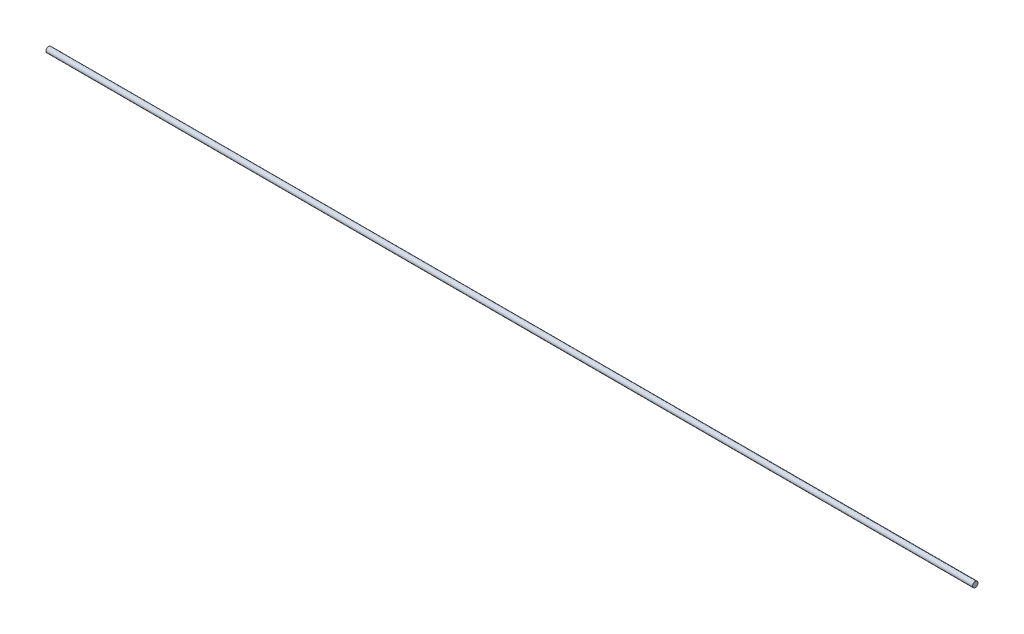
ISO-10303-21;
HEADER;
FILE_DESCRIPTION(('STEP AP214'),'2;1');
FILE_NAME('part.step','',(''),(''),'','','');
FILE_SCHEMA(('AUTOMOTIVE_DESIGN { 1 0 10303 214 1 1 1 1 }'));
ENDSEC;
DATA;
#1=APPLICATION_CONTEXT('core data for automotive mechanical design processes');
#2=APPLICATION_PROTOCOL_DEFINITION('international standard','automotive_design',2000,#1);
#3=PRODUCT_CONTEXT('',#1,'mechanical');
#4=PRODUCT('Part','Part','',(#3));
#5=PRODUCT_RELATED_PRODUCT_CATEGORY('part','',(#4));
#6=PRODUCT_DEFINITION_FORMATION('','',#4);
#7=PRODUCT_DEFINITION_CONTEXT('part definition',#1,'design');
#8=PRODUCT_DEFINITION('design','',#6,#7);
#9=PRODUCT_DEFINITION_SHAPE('','',#8);
#10=(LENGTH_UNIT() NAMED_UNIT(*) SI_UNIT(.MILLI.,.METRE.));
#11=(NAMED_UNIT(*) PLANE_ANGLE_UNIT() SI_UNIT($,.RADIAN.));
#12=(NAMED_UNIT(*) SI_UNIT($,.STERADIAN.) SOLID_ANGLE_UNIT());
#13=UNCERTAINTY_MEASURE_WITH_UNIT(LENGTH_MEASURE(1.E-05),#10,'distance_accuracy_value','');
#14=(GEOMETRIC_REPRESENTATION_CONTEXT(3) GLOBAL_UNCERTAINTY_ASSIGNED_CONTEXT((#13)) GLOBAL_UNIT_ASSIGNED_CONTEXT((#10,
#11,#12)) REPRESENTATION_CONTEXT('',''));
#15=CARTESIAN_POINT('',(0.,0.,0.));
#16=DIRECTION('',(0.,0.,1.));
#17=DIRECTION('',(1.,0.,0.));
#18=AXIS2_PLACEMENT_3D('',#15,#16,#17);
#19=CARTESIAN_POINT('',(511.,0.,0.));
#20=DIRECTION('',(1.,0.,0.));
#21=DIRECTION('',(0.,0.,-1.));
#22=AXIS2_PLACEMENT_3D('',#19,#20,#21);
#23=PLANE('',#22);
#24=CARTESIAN_POINT('',(511.,0.,0.));
#25=DIRECTION('',(1.,0.,0.));
#26=DIRECTION('',(0.,0.,-1.));
#27=AXIS2_PLACEMENT_3D('',#24,#25,#26);
#28=CIRCLE('',#27,3.);
#29=CARTESIAN_POINT('',(511.,0.,-3.));
#30=VERTEX_POINT('',#29);
#31=EDGE_CURVE('E10',#30,#30,#28,.T.);
#32=ORIENTED_EDGE('',*,*,#31,.T.);
#33=EDGE_LOOP('',(#32));
#34=FACE_BOUND('',#33,.T.);
#35=CARTESIAN_POINT('',(511.,0.,0.));
#36=DIRECTION('',(1.,0.,0.));
#37=DIRECTION('',(0.,0.,-1.));
#38=AXIS2_PLACEMENT_3D('',#35,#36,#37);
#39=CIRCLE('',#38,0.00299999999999996);
#40=CARTESIAN_POINT('',(511.,0.,-0.00299999999999996));
#41=VERTEX_POINT('',#40);
#42=EDGE_CURVE('E42',#41,#41,#39,.T.);
#43=ORIENTED_EDGE('',*,*,#42,.F.);
#44=EDGE_LOOP('',(#43));
#45=FACE_BOUND('',#44,.T.);
#46=ADVANCED_FACE('F31',(#34,#45),#23,.T.);
#47=CARTESIAN_POINT('',(-511.,0.,0.));
#48=DIRECTION('',(1.,0.,0.));
#49=DIRECTION('',(0.,0.,-1.));
#50=AXIS2_PLACEMENT_3D('',#47,#48,#49);
#51=PLANE('',#50);
#52=CARTESIAN_POINT('',(-511.,0.,0.));
#53=DIRECTION('',(1.,0.,0.));
#54=DIRECTION('',(0.,0.,-1.));
#55=AXIS2_PLACEMENT_3D('',#52,#53,#54);
#56=CIRCLE('',#55,3.);
#57=CARTESIAN_POINT('',(-511.,0.,-3.));
#58=VERTEX_POINT('',#57);
#59=EDGE_CURVE('E35',#58,#58,#56,.T.);
#60=ORIENTED_EDGE('',*,*,#59,.F.);
#61=EDGE_LOOP('',(#60));
#62=FACE_BOUND('',#61,.T.);
#63=CARTESIAN_POINT('',(-511.,0.,0.));
#64=DIRECTION('',(1.,0.,0.));
#65=DIRECTION('',(0.,0.,-1.));
#66=AXIS2_PLACEMENT_3D('',#63,#64,#65);
#67=CIRCLE('',#66,0.00299999999999996);
#68=CARTESIAN_POINT('',(-511.,0.,-0.00299999999999996));
#69=VERTEX_POINT('',#68);
#70=EDGE_CURVE('E44',#69,#69,#67,.T.);
#71=ORIENTED_EDGE('',*,*,#70,.T.);
#72=EDGE_LOOP('',(#71));
#73=FACE_BOUND('',#72,.T.);
#74=ADVANCED_FACE('F54',(#62,#73),#51,.F.);
#75=CARTESIAN_POINT('',(511.,0.,0.));
#76=DIRECTION('',(-1.,0.,0.));
#77=DIRECTION('',(0.,0.,1.));
#78=AXIS2_PLACEMENT_3D('',#75,#76,#77);
#79=CYLINDRICAL_SURFACE('',#78,3.);
#80=ORIENTED_EDGE('',*,*,#31,.F.);
#81=EDGE_LOOP('',(#80));
#82=FACE_BOUND('',#81,.T.);
#83=ORIENTED_EDGE('',*,*,#59,.T.);
#84=EDGE_LOOP('',(#83));
#85=FACE_BOUND('',#84,.T.);
#86=ADVANCED_FACE('F33',(#82,#85),#79,.T.);
#87=CARTESIAN_POINT('',(511.,0.,0.));
#88=DIRECTION('',(-1.,0.,0.));
#89=DIRECTION('',(0.,0.,1.));
#90=AXIS2_PLACEMENT_3D('',#87,#88,#89);
#91=CYLINDRICAL_SURFACE('',#90,0.00299999999999996);
#92=ORIENTED_EDGE('',*,*,#42,.T.);
#93=EDGE_LOOP('',(#92));
#94=FACE_BOUND('',#93,.T.);
#95=ORIENTED_EDGE('',*,*,#70,.F.);
#96=EDGE_LOOP('',(#95));
#97=FACE_BOUND('',#96,.T.);
#98=ADVANCED_FACE('F50',(#94,#97),#91,.F.);
#99=CLOSED_SHELL('',(#46,#74,#86,#98));
#100=MANIFOLD_SOLID_BREP('B2',#99);
#101=ADVANCED_BREP_SHAPE_REPRESENTATION('',(#18,#100),#14);
#102=SHAPE_DEFINITION_REPRESENTATION(#9,#101);
ENDSEC;
END-ISO-10303-21;
